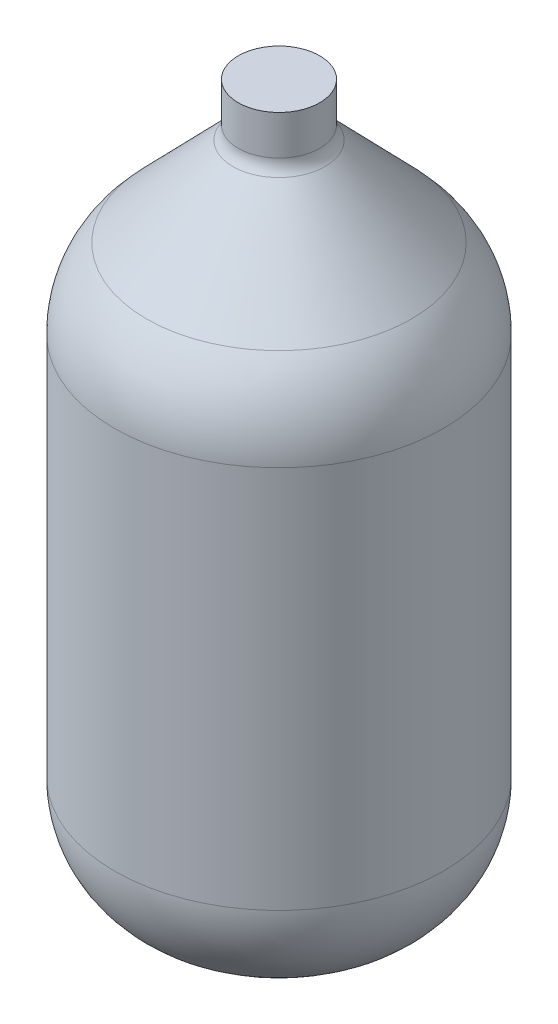
ISO-10303-21;
HEADER;
FILE_DESCRIPTION(('STEP AP214'),'2;1');
FILE_NAME('part.step','',(''),(''),'','','');
FILE_SCHEMA(('AUTOMOTIVE_DESIGN { 1 0 10303 214 1 1 1 1 }'));
ENDSEC;
DATA;
#1=APPLICATION_CONTEXT('core data for automotive mechanical design processes');
#2=APPLICATION_PROTOCOL_DEFINITION('international standard','automotive_design',2000,#1);
#3=PRODUCT_CONTEXT('',#1,'mechanical');
#4=PRODUCT('Part','Part','',(#3));
#5=PRODUCT_RELATED_PRODUCT_CATEGORY('part','',(#4));
#6=PRODUCT_DEFINITION_FORMATION('','',#4);
#7=PRODUCT_DEFINITION_CONTEXT('part definition',#1,'design');
#8=PRODUCT_DEFINITION('design','',#6,#7);
#9=PRODUCT_DEFINITION_SHAPE('','',#8);
#10=(LENGTH_UNIT() NAMED_UNIT(*) SI_UNIT(.MILLI.,.METRE.));
#11=(NAMED_UNIT(*) PLANE_ANGLE_UNIT() SI_UNIT($,.RADIAN.));
#12=(NAMED_UNIT(*) SI_UNIT($,.STERADIAN.) SOLID_ANGLE_UNIT());
#13=UNCERTAINTY_MEASURE_WITH_UNIT(LENGTH_MEASURE(1.E-05),#10,'distance_accuracy_value','');
#14=(GEOMETRIC_REPRESENTATION_CONTEXT(3) GLOBAL_UNCERTAINTY_ASSIGNED_CONTEXT((#13)) GLOBAL_UNIT_ASSIGNED_CONTEXT((#10,
#11,#12)) REPRESENTATION_CONTEXT('',''));
#15=CARTESIAN_POINT('',(0.,0.,0.));
#16=DIRECTION('',(0.,0.,1.));
#17=DIRECTION('',(1.,0.,0.));
#18=AXIS2_PLACEMENT_3D('',#15,#16,#17);
#19=CARTESIAN_POINT('',(0.,138.762295451101,-13.716));
#20=DIRECTION('',(0.,-1.,0.));
#21=DIRECTION('',(0.,0.,-1.));
#22=AXIS2_PLACEMENT_3D('',#19,#20,#21);
#23=PLANE('',#22);
#24=CARTESIAN_POINT('',(0.,138.762295451101,0.));
#25=DIRECTION('',(0.,1.,0.));
#26=DIRECTION('',(0.,0.,1.));
#27=AXIS2_PLACEMENT_3D('',#24,#25,#26);
#28=CIRCLE('',#27,13.716);
#29=CARTESIAN_POINT('',(0.,138.762295451101,13.716));
#30=VERTEX_POINT('',#29);
#31=EDGE_CURVE('E60',#30,#30,#28,.T.);
#32=ORIENTED_EDGE('',*,*,#31,.T.);
#33=EDGE_LOOP('',(#32));
#34=FACE_BOUND('',#33,.T.);
#35=ADVANCED_FACE('F32',(#34),#23,.F.);
#36=CARTESIAN_POINT('',(0.,-75.9501192847895,0.));
#37=DIRECTION('',(0.,1.,0.));
#38=DIRECTION('',(0.,0.,1.));
#39=AXIS2_PLACEMENT_3D('',#36,#37,#38);
#40=SPHERICAL_SURFACE('',#39,38.1);
#41=CARTESIAN_POINT('',(0.,-107.757455093627,0.));
#42=DIRECTION('',(0.,1.,0.));
#43=DIRECTION('',(0.,0.,1.));
#44=AXIS2_PLACEMENT_3D('',#41,#42,#43);
#45=CIRCLE('',#44,20.9738739565159);
#46=CARTESIAN_POINT('',(0.,-107.757455093627,20.9738739565159));
#47=VERTEX_POINT('',#46);
#48=EDGE_CURVE('E10',#47,#47,#45,.T.);
#49=ORIENTED_EDGE('',*,*,#48,.F.);
#50=EDGE_LOOP('',(#49));
#51=FACE_BOUND('',#50,.T.);
#52=ADVANCED_FACE('F102',(#51),#40,.T.);
#53=CARTESIAN_POINT('',(0.,-107.757455093627,0.));
#54=DIRECTION('',(0.,1.,0.));
#55=DIRECTION('',(0.,0.,1.));
#56=AXIS2_PLACEMENT_3D('',#53,#54,#55);
#57=CONICAL_SURFACE('',#56,20.9738739565159,0.98783882117545);
#58=CARTESIAN_POINT('',(0.,-96.3682349101412,0.));
#59=DIRECTION('',(0.,1.,0.));
#60=DIRECTION('',(0.,0.,1.));
#61=AXIS2_PLACEMENT_3D('',#58,#59,#60);
#62=CIRCLE('',#61,38.2458739565159);
#63=CARTESIAN_POINT('',(0.,-96.3682349101412,38.2458739565159));
#64=VERTEX_POINT('',#63);
#65=EDGE_CURVE('E38',#64,#64,#62,.T.);
#66=ORIENTED_EDGE('',*,*,#65,.F.);
#67=EDGE_LOOP('',(#66));
#68=FACE_BOUND('',#67,.T.);
#69=ORIENTED_EDGE('',*,*,#48,.T.);
#70=EDGE_LOOP('',(#69));
#71=FACE_BOUND('',#70,.T.);
#72=ADVANCED_FACE('F97',(#68,#71),#57,.T.);
#73=CARTESIAN_POINT('',(0.,-64.5608991013033,0.));
#74=DIRECTION('',(0.,1.,0.));
#75=DIRECTION('',(0.,0.,1.));
#76=AXIS2_PLACEMENT_3D('',#73,#74,#75);
#77=DEGENERATE_TOROIDAL_SURFACE('',#76,17.272,38.1,.T.);
#78=CARTESIAN_POINT('',(0.,-64.5608991013032,0.));
#79=DIRECTION('',(0.,1.,0.));
#80=DIRECTION('',(0.,0.,1.));
#81=AXIS2_PLACEMENT_3D('',#78,#79,#80);
#82=CIRCLE('',#81,55.372);
#83=CARTESIAN_POINT('',(0.,-64.5608991013032,55.372));
#84=VERTEX_POINT('',#83);
#85=EDGE_CURVE('E42',#84,#84,#82,.T.);
#86=ORIENTED_EDGE('',*,*,#85,.F.);
#87=EDGE_LOOP('',(#86));
#88=FACE_BOUND('',#87,.T.);
#89=ORIENTED_EDGE('',*,*,#65,.T.);
#90=EDGE_LOOP('',(#89));
#91=FACE_BOUND('',#90,.T.);
#92=ADVANCED_FACE('F92',(#88,#91),#77,.T.);
#93=CARTESIAN_POINT('',(0.,138.762295451101,0.));
#94=DIRECTION('',(0.,1.,0.));
#95=DIRECTION('',(0.,0.,1.));
#96=AXIS2_PLACEMENT_3D('',#93,#94,#95);
#97=CYLINDRICAL_SURFACE('',#96,55.372);
#98=CARTESIAN_POINT('',(0.,64.5608991013033,0.));
#99=DIRECTION('',(0.,1.,0.));
#100=DIRECTION('',(0.,0.,1.));
#101=AXIS2_PLACEMENT_3D('',#98,#99,#100);
#102=CIRCLE('',#101,55.372);
#103=CARTESIAN_POINT('',(0.,64.5608991013033,55.372));
#104=VERTEX_POINT('',#103);
#105=EDGE_CURVE('E46',#104,#104,#102,.T.);
#106=ORIENTED_EDGE('',*,*,#105,.F.);
#107=EDGE_LOOP('',(#106));
#108=FACE_BOUND('',#107,.T.);
#109=ORIENTED_EDGE('',*,*,#85,.T.);
#110=EDGE_LOOP('',(#109));
#111=FACE_BOUND('',#110,.T.);
#112=ADVANCED_FACE('F86',(#108,#111),#97,.T.);
#113=CARTESIAN_POINT('',(0.,64.5608991013033,0.));
#114=DIRECTION('',(0.,1.,0.));
#115=DIRECTION('',(0.,0.,1.));
#116=AXIS2_PLACEMENT_3D('',#113,#114,#115);
#117=DEGENERATE_TOROIDAL_SURFACE('',#116,17.272,38.1,.T.);
#118=CARTESIAN_POINT('',(0.,91.1143831706773,0.));
#119=DIRECTION('',(0.,1.,0.));
#120=DIRECTION('',(0.,0.,1.));
#121=AXIS2_PLACEMENT_3D('',#118,#119,#120);
#122=CIRCLE('',#121,44.5945636384564);
#123=CARTESIAN_POINT('',(0.,91.1143831706773,44.5945636384564));
#124=VERTEX_POINT('',#123);
#125=EDGE_CURVE('E51',#124,#124,#122,.T.);
#126=ORIENTED_EDGE('',*,*,#125,.F.);
#127=EDGE_LOOP('',(#126));
#128=FACE_BOUND('',#127,.T.);
#129=ORIENTED_EDGE('',*,*,#105,.T.);
#130=EDGE_LOOP('',(#129));
#131=FACE_BOUND('',#130,.T.);
#132=ADVANCED_FACE('F80',(#128,#131),#117,.T.);
#133=CARTESIAN_POINT('',(0.,91.1143831706773,0.));
#134=DIRECTION('',(0.,-1.,0.));
#135=DIRECTION('',(0.,0.,-1.));
#136=AXIS2_PLACEMENT_3D('',#133,#134,#135);
#137=CONICAL_SURFACE('',#136,44.5945636384564,0.771124151690305);
#138=CARTESIAN_POINT('',(0.,121.039030831172,0.));
#139=DIRECTION('',(0.,1.,0.));
#140=DIRECTION('',(0.,0.,1.));
#141=AXIS2_PLACEMENT_3D('',#138,#139,#140);
#142=CIRCLE('',#141,15.5122393935906);
#143=CARTESIAN_POINT('',(0.,121.039030831172,15.5122393935906));
#144=VERTEX_POINT('',#143);
#145=EDGE_CURVE('E54',#144,#144,#142,.T.);
#146=ORIENTED_EDGE('',*,*,#145,.F.);
#147=EDGE_LOOP('',(#146));
#148=FACE_BOUND('',#147,.T.);
#149=ORIENTED_EDGE('',*,*,#125,.T.);
#150=EDGE_LOOP('',(#149));
#151=FACE_BOUND('',#150,.T.);
#152=ADVANCED_FACE('F74',(#148,#151),#137,.T.);
#153=CARTESIAN_POINT('',(0.,125.464611509401,0.));
#154=DIRECTION('',(0.,1.,0.));
#155=DIRECTION('',(0.,0.,1.));
#156=AXIS2_PLACEMENT_3D('',#153,#154,#155);
#157=TOROIDAL_SURFACE('',#156,20.066,6.35);
#158=CARTESIAN_POINT('',(0.,125.464611509401,0.));
#159=DIRECTION('',(0.,1.,0.));
#160=DIRECTION('',(0.,0.,1.));
#161=AXIS2_PLACEMENT_3D('',#158,#159,#160);
#162=CIRCLE('',#161,13.716);
#163=CARTESIAN_POINT('',(0.,125.464611509401,13.716));
#164=VERTEX_POINT('',#163);
#165=EDGE_CURVE('E57',#164,#164,#162,.T.);
#166=ORIENTED_EDGE('',*,*,#165,.F.);
#167=EDGE_LOOP('',(#166));
#168=FACE_BOUND('',#167,.T.);
#169=ORIENTED_EDGE('',*,*,#145,.T.);
#170=EDGE_LOOP('',(#169));
#171=FACE_BOUND('',#170,.T.);
#172=ADVANCED_FACE('F68',(#168,#171),#157,.F.);
#173=CARTESIAN_POINT('',(0.,138.762295451101,0.));
#174=DIRECTION('',(0.,1.,0.));
#175=DIRECTION('',(0.,0.,1.));
#176=AXIS2_PLACEMENT_3D('',#173,#174,#175);
#177=CYLINDRICAL_SURFACE('',#176,13.716);
#178=ORIENTED_EDGE('',*,*,#31,.F.);
#179=EDGE_LOOP('',(#178));
#180=FACE_BOUND('',#179,.T.);
#181=ORIENTED_EDGE('',*,*,#165,.T.);
#182=EDGE_LOOP('',(#181));
#183=FACE_BOUND('',#182,.T.);
#184=ADVANCED_FACE('F65',(#180,#183),#177,.T.);
#185=CLOSED_SHELL('',(#35,#52,#72,#92,#112,#132,#152,#172,#184));
#186=MANIFOLD_SOLID_BREP('B2',#185);
#187=ADVANCED_BREP_SHAPE_REPRESENTATION('',(#18,#186),#14);
#188=SHAPE_DEFINITION_REPRESENTATION(#9,#187);
ENDSEC;
END-ISO-10303-21;
